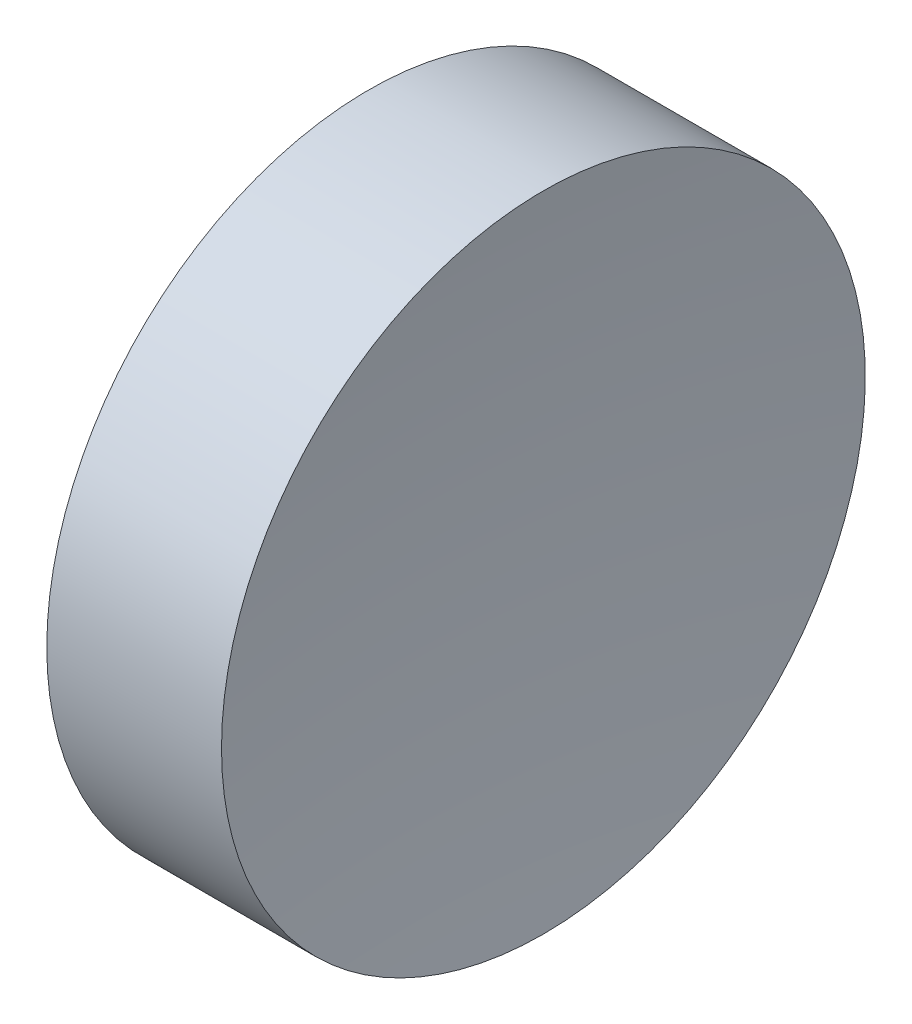
ISO-10303-21;
HEADER;
FILE_DESCRIPTION(('STEP AP214'),'2;1');
FILE_NAME('part.step','',(''),(''),'','','');
FILE_SCHEMA(('AUTOMOTIVE_DESIGN { 1 0 10303 214 1 1 1 1 }'));
ENDSEC;
DATA;
#1=APPLICATION_CONTEXT('core data for automotive mechanical design processes');
#2=APPLICATION_PROTOCOL_DEFINITION('international standard','automotive_design',2000,#1);
#3=PRODUCT_CONTEXT('',#1,'mechanical');
#4=PRODUCT('Part','Part','',(#3));
#5=PRODUCT_RELATED_PRODUCT_CATEGORY('part','',(#4));
#6=PRODUCT_DEFINITION_FORMATION('','',#4);
#7=PRODUCT_DEFINITION_CONTEXT('part definition',#1,'design');
#8=PRODUCT_DEFINITION('design','',#6,#7);
#9=PRODUCT_DEFINITION_SHAPE('','',#8);
#10=(LENGTH_UNIT() NAMED_UNIT(*) SI_UNIT(.MILLI.,.METRE.));
#11=(NAMED_UNIT(*) PLANE_ANGLE_UNIT() SI_UNIT($,.RADIAN.));
#12=(NAMED_UNIT(*) SI_UNIT($,.STERADIAN.) SOLID_ANGLE_UNIT());
#13=UNCERTAINTY_MEASURE_WITH_UNIT(LENGTH_MEASURE(1.E-05),#10,'distance_accuracy_value','');
#14=(GEOMETRIC_REPRESENTATION_CONTEXT(3) GLOBAL_UNCERTAINTY_ASSIGNED_CONTEXT((#13)) GLOBAL_UNIT_ASSIGNED_CONTEXT((#10,
#11,#12)) REPRESENTATION_CONTEXT('',''));
#15=CARTESIAN_POINT('',(0.,0.,0.));
#16=DIRECTION('',(0.,0.,1.));
#17=DIRECTION('',(1.,0.,0.));
#18=AXIS2_PLACEMENT_3D('',#15,#16,#17);
#19=CARTESIAN_POINT('',(221.092655229493,69.3780211233724,0.));
#20=DIRECTION('',(-1.,0.,0.));
#21=DIRECTION('',(0.,-1.,0.));
#22=AXIS2_PLACEMENT_3D('',#19,#20,#21);
#23=SPHERICAL_SURFACE('',#22,100.);
#24=CARTESIAN_POINT('',(121.876981064571,69.3780211233724,0.));
#25=DIRECTION('',(-1.,0.,0.));
#26=DIRECTION('',(0.,0.,1.));
#27=AXIS2_PLACEMENT_3D('',#24,#25,#26);
#28=CIRCLE('',#27,12.5);
#29=CARTESIAN_POINT('',(121.876981064571,69.3780211233724,12.5));
#30=VERTEX_POINT('',#29);
#31=EDGE_CURVE('E10',#30,#30,#28,.T.);
#32=ORIENTED_EDGE('',*,*,#31,.F.);
#33=EDGE_LOOP('',(#32));
#34=FACE_BOUND('',#33,.T.);
#35=ADVANCED_FACE('F35',(#34),#23,.F.);
#36=CARTESIAN_POINT('',(108.985143002165,69.3780211233724,0.));
#37=DIRECTION('',(-1.,0.,0.));
#38=DIRECTION('',(0.,0.,1.));
#39=AXIS2_PLACEMENT_3D('',#36,#37,#38);
#40=CYLINDRICAL_SURFACE('',#39,12.5);
#41=CARTESIAN_POINT('',(115.09265553492,69.3780211233724,0.));
#42=DIRECTION('',(-1.,0.,0.));
#43=DIRECTION('',(0.,0.,1.));
#44=AXIS2_PLACEMENT_3D('',#41,#42,#43);
#45=CIRCLE('',#44,12.5);
#46=CARTESIAN_POINT('',(115.09265553492,69.3780211233724,12.5));
#47=VERTEX_POINT('',#46);
#48=EDGE_CURVE('E41',#47,#47,#45,.T.);
#49=ORIENTED_EDGE('',*,*,#48,.F.);
#50=EDGE_LOOP('',(#49));
#51=FACE_BOUND('',#50,.T.);
#52=ORIENTED_EDGE('',*,*,#31,.T.);
#53=EDGE_LOOP('',(#52));
#54=FACE_BOUND('',#53,.T.);
#55=ADVANCED_FACE('F49',(#51,#54),#40,.T.);
#56=CARTESIAN_POINT('',(115.09265553492,69.3780211233724,0.));
#57=DIRECTION('',(1.,0.,0.));
#58=DIRECTION('',(0.,0.,-1.));
#59=AXIS2_PLACEMENT_3D('',#56,#57,#58);
#60=PLANE('',#59);
#61=ORIENTED_EDGE('',*,*,#48,.T.);
#62=EDGE_LOOP('',(#61));
#63=FACE_BOUND('',#62,.T.);
#64=ADVANCED_FACE('F47',(#63),#60,.F.);
#65=CLOSED_SHELL('',(#35,#55,#64));
#66=MANIFOLD_SOLID_BREP('B2',#65);
#67=ADVANCED_BREP_SHAPE_REPRESENTATION('',(#18,#66),#14);
#68=SHAPE_DEFINITION_REPRESENTATION(#9,#67);
ENDSEC;
END-ISO-10303-21;
